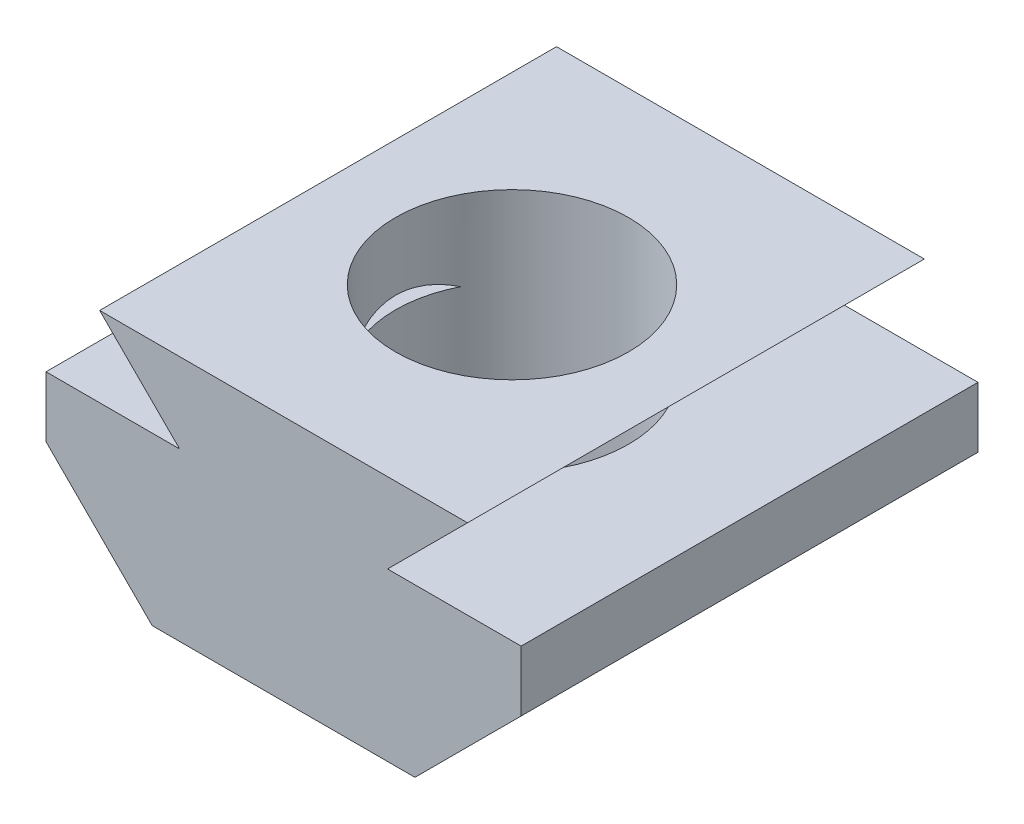
ISO-10303-21;
HEADER;
FILE_DESCRIPTION(('STEP AP214'),'2;1');
FILE_NAME('part.step','',(''),(''),'','','');
FILE_SCHEMA(('AUTOMOTIVE_DESIGN { 1 0 10303 214 1 1 1 1 }'));
ENDSEC;
DATA;
#1=APPLICATION_CONTEXT('core data for automotive mechanical design processes');
#2=APPLICATION_PROTOCOL_DEFINITION('international standard','automotive_design',2000,#1);
#3=PRODUCT_CONTEXT('',#1,'mechanical');
#4=PRODUCT('Part','Part','',(#3));
#5=PRODUCT_RELATED_PRODUCT_CATEGORY('part','',(#4));
#6=PRODUCT_DEFINITION_FORMATION('','',#4);
#7=PRODUCT_DEFINITION_CONTEXT('part definition',#1,'design');
#8=PRODUCT_DEFINITION('design','',#6,#7);
#9=PRODUCT_DEFINITION_SHAPE('','',#8);
#10=(LENGTH_UNIT() NAMED_UNIT(*) SI_UNIT(.MILLI.,.METRE.));
#11=(NAMED_UNIT(*) PLANE_ANGLE_UNIT() SI_UNIT($,.RADIAN.));
#12=(NAMED_UNIT(*) SI_UNIT($,.STERADIAN.) SOLID_ANGLE_UNIT());
#13=UNCERTAINTY_MEASURE_WITH_UNIT(LENGTH_MEASURE(1.E-05),#10,'distance_accuracy_value','');
#14=(GEOMETRIC_REPRESENTATION_CONTEXT(3) GLOBAL_UNCERTAINTY_ASSIGNED_CONTEXT((#13)) GLOBAL_UNIT_ASSIGNED_CONTEXT((#10,
#11,#12)) REPRESENTATION_CONTEXT('',''));
#15=CARTESIAN_POINT('',(0.,0.,0.));
#16=DIRECTION('',(0.,0.,1.));
#17=DIRECTION('',(1.,0.,0.));
#18=AXIS2_PLACEMENT_3D('',#15,#16,#17);
#19=CARTESIAN_POINT('',(-4.02573593128808,-0.3,10.));
#20=DIRECTION('',(0.707106781186548,0.707106781186547,0.));
#21=DIRECTION('',(-0.707106781186547,0.707106781186548,0.));
#22=AXIS2_PLACEMENT_3D('',#19,#20,#21);
#23=PLANE('',#22);
#24=DIRECTION('',(0.,0.,-1.));
#25=VECTOR('',#24,1.);
#26=CARTESIAN_POINT('',(-2.27573593128808,-2.05,10.));
#27=LINE('',#26,#25);
#28=CARTESIAN_POINT('',(-2.27573593128808,-2.05,3.84955401211339));
#29=VERTEX_POINT('',#28);
#30=CARTESIAN_POINT('',(-2.27573593128808,-2.05,0.));
#31=VERTEX_POINT('',#30);
#32=EDGE_CURVE('E44',#29,#31,#27,.T.);
#33=ORIENTED_EDGE('',*,*,#32,.F.);
#34=CARTESIAN_POINT('',(0.,-4.32573593128808,5.));
#35=DIRECTION('',(0.707106781186548,0.707106781186547,0.));
#36=DIRECTION('',(-0.707106781186547,0.707106781186548,0.));
#37=AXIS2_PLACEMENT_3D('',#34,#35,#36);
#38=ELLIPSE('',#37,3.60624458405139,2.55);
#39=CARTESIAN_POINT('',(-2.27573593128808,-2.05,6.15044598788661));
#40=VERTEX_POINT('',#39);
#41=EDGE_CURVE('E50',#29,#40,#38,.T.);
#42=ORIENTED_EDGE('',*,*,#41,.T.);
#43=CARTESIAN_POINT('',(-2.27573593128808,-2.05,10.));
#44=VERTEX_POINT('',#43);
#45=EDGE_CURVE('E11',#44,#40,#27,.T.);
#46=ORIENTED_EDGE('',*,*,#45,.F.);
#47=DIRECTION('',(0.707106781186547,-0.707106781186548,0.));
#48=VECTOR('',#47,1.);
#49=CARTESIAN_POINT('',(-4.02573593128808,-0.3,10.));
#50=LINE('',#49,#48);
#51=CARTESIAN_POINT('',(-4.02573593128808,-0.3,10.));
#52=VERTEX_POINT('',#51);
#53=EDGE_CURVE('E206',#52,#44,#50,.T.);
#54=ORIENTED_EDGE('',*,*,#53,.F.);
#55=DIRECTION('',(0.,0.,-1.));
#56=VECTOR('',#55,1.);
#57=CARTESIAN_POINT('',(-4.02573593128808,-0.3,10.));
#58=LINE('',#57,#56);
#59=CARTESIAN_POINT('',(-4.02573593128808,-0.3,0.));
#60=VERTEX_POINT('',#59);
#61=EDGE_CURVE('E185',#52,#60,#58,.T.);
#62=ORIENTED_EDGE('',*,*,#61,.T.);
#63=DIRECTION('',(0.707106781186547,-0.707106781186548,0.));
#64=VECTOR('',#63,1.);
#65=CARTESIAN_POINT('',(-4.02573593128808,-0.3,0.));
#66=LINE('',#65,#64);
#67=EDGE_CURVE('E178',#60,#31,#66,.T.);
#68=ORIENTED_EDGE('',*,*,#67,.T.);
#69=EDGE_LOOP('',(#33,#42,#46,#54,#62,#68));
#70=FACE_BOUND('',#69,.T.);
#71=ADVANCED_FACE('F37',(#70),#23,.F.);
#72=CARTESIAN_POINT('',(-2.27573593128808,-2.05,10.));
#73=DIRECTION('',(0.,-1.,0.));
#74=DIRECTION('',(0.,0.,-1.));
#75=AXIS2_PLACEMENT_3D('',#72,#73,#74);
#76=PLANE('',#75);
#77=ORIENTED_EDGE('',*,*,#45,.T.);
#78=CARTESIAN_POINT('',(0.,-2.05,5.));
#79=DIRECTION('',(0.,-1.,0.));
#80=DIRECTION('',(0.,0.,-1.));
#81=AXIS2_PLACEMENT_3D('',#78,#79,#80);
#82=CIRCLE('',#81,2.55);
#83=EDGE_CURVE('E137',#40,#29,#82,.T.);
#84=ORIENTED_EDGE('',*,*,#83,.T.);
#85=ORIENTED_EDGE('',*,*,#32,.T.);
#86=DIRECTION('',(-1.,0.,0.));
#87=VECTOR('',#86,1.);
#88=CARTESIAN_POINT('',(-2.27573593128808,-2.05,0.));
#89=LINE('',#88,#87);
#90=CARTESIAN_POINT('',(-5.20000000000001,-2.05,0.));
#91=VERTEX_POINT('',#90);
#92=EDGE_CURVE('E171',#31,#91,#89,.T.);
#93=ORIENTED_EDGE('',*,*,#92,.T.);
#94=DIRECTION('',(0.,0.,-1.));
#95=VECTOR('',#94,1.);
#96=CARTESIAN_POINT('',(-5.20000000000001,-2.05,10.));
#97=LINE('',#96,#95);
#98=CARTESIAN_POINT('',(-5.20000000000001,-2.05,10.));
#99=VERTEX_POINT('',#98);
#100=EDGE_CURVE('E161',#99,#91,#97,.T.);
#101=ORIENTED_EDGE('',*,*,#100,.F.);
#102=DIRECTION('',(-1.,0.,0.));
#103=VECTOR('',#102,1.);
#104=CARTESIAN_POINT('',(-2.27573593128808,-2.05,10.));
#105=LINE('',#104,#103);
#106=EDGE_CURVE('E224',#44,#99,#105,.T.);
#107=ORIENTED_EDGE('',*,*,#106,.F.);
#108=EDGE_LOOP('',(#77,#84,#85,#93,#101,#107));
#109=FACE_BOUND('',#108,.T.);
#110=ADVANCED_FACE('F170',(#109),#76,.F.);
#111=CARTESIAN_POINT('',(-5.20000000000001,-2.05,10.));
#112=DIRECTION('',(1.,0.,0.));
#113=DIRECTION('',(0.,0.,-1.));
#114=AXIS2_PLACEMENT_3D('',#111,#112,#113);
#115=PLANE('',#114);
#116=DIRECTION('',(0.,-1.,0.));
#117=VECTOR('',#116,1.);
#118=CARTESIAN_POINT('',(-5.20000000000001,-2.05,0.));
#119=LINE('',#118,#117);
#120=CARTESIAN_POINT('',(-5.20000000000001,-3.37573593128806,0.));
#121=VERTEX_POINT('',#120);
#122=EDGE_CURVE('E180',#91,#121,#119,.T.);
#123=ORIENTED_EDGE('',*,*,#122,.T.);
#124=DIRECTION('',(0.,0.,-1.));
#125=VECTOR('',#124,1.);
#126=CARTESIAN_POINT('',(-5.20000000000001,-3.37573593128806,10.));
#127=LINE('',#126,#125);
#128=CARTESIAN_POINT('',(-5.20000000000001,-3.37573593128806,10.));
#129=VERTEX_POINT('',#128);
#130=EDGE_CURVE('E159',#129,#121,#127,.T.);
#131=ORIENTED_EDGE('',*,*,#130,.F.);
#132=DIRECTION('',(0.,-1.,0.));
#133=VECTOR('',#132,1.);
#134=CARTESIAN_POINT('',(-5.20000000000001,-2.05,10.));
#135=LINE('',#134,#133);
#136=EDGE_CURVE('E222',#99,#129,#135,.T.);
#137=ORIENTED_EDGE('',*,*,#136,.F.);
#138=ORIENTED_EDGE('',*,*,#100,.T.);
#139=EDGE_LOOP('',(#123,#131,#137,#138));
#140=FACE_BOUND('',#139,.T.);
#141=ADVANCED_FACE('F267',(#140),#115,.F.);
#142=CARTESIAN_POINT('',(-5.20000000000001,-3.37573593128806,10.));
#143=DIRECTION('',(0.707106781186548,0.707106781186548,0.));
#144=DIRECTION('',(-0.707106781186548,0.707106781186548,0.));
#145=AXIS2_PLACEMENT_3D('',#142,#143,#144);
#146=PLANE('',#145);
#147=DIRECTION('',(0.707106781186548,-0.707106781186548,0.));
#148=VECTOR('',#147,1.);
#149=CARTESIAN_POINT('',(-5.20000000000001,-3.37573593128806,0.));
#150=LINE('',#149,#148);
#151=CARTESIAN_POINT('',(-2.87573593128807,-5.7,0.));
#152=VERTEX_POINT('',#151);
#153=EDGE_CURVE('E193',#121,#152,#150,.T.);
#154=ORIENTED_EDGE('',*,*,#153,.T.);
#155=DIRECTION('',(0.,0.,-1.));
#156=VECTOR('',#155,1.);
#157=CARTESIAN_POINT('',(-2.87573593128807,-5.7,10.));
#158=LINE('',#157,#156);
#159=CARTESIAN_POINT('',(-2.87573593128807,-5.7,10.));
#160=VERTEX_POINT('',#159);
#161=EDGE_CURVE('E156',#160,#152,#158,.T.);
#162=ORIENTED_EDGE('',*,*,#161,.F.);
#163=DIRECTION('',(0.707106781186548,-0.707106781186548,0.));
#164=VECTOR('',#163,1.);
#165=CARTESIAN_POINT('',(-5.20000000000001,-3.37573593128806,10.));
#166=LINE('',#165,#164);
#167=EDGE_CURVE('E220',#129,#160,#166,.T.);
#168=ORIENTED_EDGE('',*,*,#167,.F.);
#169=ORIENTED_EDGE('',*,*,#130,.T.);
#170=EDGE_LOOP('',(#154,#162,#168,#169));
#171=FACE_BOUND('',#170,.T.);
#172=ADVANCED_FACE('F265',(#171),#146,.F.);
#173=CARTESIAN_POINT('',(2.87573593128807,-5.7,10.));
#174=DIRECTION('',(0.,1.,0.));
#175=DIRECTION('',(0.,0.,1.));
#176=AXIS2_PLACEMENT_3D('',#173,#174,#175);
#177=PLANE('',#176);
#178=CARTESIAN_POINT('',(0.,-5.7,5.));
#179=DIRECTION('',(0.,1.,0.));
#180=DIRECTION('',(-1.,0.,0.));
#181=AXIS2_PLACEMENT_3D('',#178,#179,#180);
#182=CIRCLE('',#181,2.55);
#183=CARTESIAN_POINT('',(-2.55,-5.7,5.));
#184=VERTEX_POINT('',#183);
#185=EDGE_CURVE('E127',#184,#184,#182,.T.);
#186=ORIENTED_EDGE('',*,*,#185,.T.);
#187=EDGE_LOOP('',(#186));
#188=FACE_BOUND('',#187,.T.);
#189=DIRECTION('',(1.,0.,0.));
#190=VECTOR('',#189,1.);
#191=CARTESIAN_POINT('',(2.87573593128807,-5.7,0.));
#192=LINE('',#191,#190);
#193=CARTESIAN_POINT('',(2.87573593128807,-5.7,0.));
#194=VERTEX_POINT('',#193);
#195=EDGE_CURVE('E195',#152,#194,#192,.T.);
#196=ORIENTED_EDGE('',*,*,#195,.T.);
#197=DIRECTION('',(0.,0.,-1.));
#198=VECTOR('',#197,1.);
#199=CARTESIAN_POINT('',(2.87573593128807,-5.7,10.));
#200=LINE('',#199,#198);
#201=CARTESIAN_POINT('',(2.87573593128807,-5.7,10.));
#202=VERTEX_POINT('',#201);
#203=EDGE_CURVE('E153',#202,#194,#200,.T.);
#204=ORIENTED_EDGE('',*,*,#203,.F.);
#205=DIRECTION('',(1.,0.,0.));
#206=VECTOR('',#205,1.);
#207=CARTESIAN_POINT('',(2.87573593128807,-5.7,10.));
#208=LINE('',#207,#206);
#209=EDGE_CURVE('E218',#160,#202,#208,.T.);
#210=ORIENTED_EDGE('',*,*,#209,.F.);
#211=ORIENTED_EDGE('',*,*,#161,.T.);
#212=EDGE_LOOP('',(#196,#204,#210,#211));
#213=FACE_BOUND('',#212,.T.);
#214=ADVANCED_FACE('F234',(#188,#213),#177,.F.);
#215=CARTESIAN_POINT('',(5.2,-3.37573593128807,10.));
#216=DIRECTION('',(-0.707106781186548,0.707106781186548,0.));
#217=DIRECTION('',(-0.707106781186548,-0.707106781186548,0.));
#218=AXIS2_PLACEMENT_3D('',#215,#216,#217);
#219=PLANE('',#218);
#220=DIRECTION('',(0.707106781186548,0.707106781186548,0.));
#221=VECTOR('',#220,1.);
#222=CARTESIAN_POINT('',(5.2,-3.37573593128807,0.));
#223=LINE('',#222,#221);
#224=CARTESIAN_POINT('',(5.2,-3.37573593128807,0.));
#225=VERTEX_POINT('',#224);
#226=EDGE_CURVE('E197',#194,#225,#223,.T.);
#227=ORIENTED_EDGE('',*,*,#226,.T.);
#228=DIRECTION('',(0.,0.,-1.));
#229=VECTOR('',#228,1.);
#230=CARTESIAN_POINT('',(5.2,-3.37573593128807,10.));
#231=LINE('',#230,#229);
#232=CARTESIAN_POINT('',(5.2,-3.37573593128807,10.));
#233=VERTEX_POINT('',#232);
#234=EDGE_CURVE('E145',#233,#225,#231,.T.);
#235=ORIENTED_EDGE('',*,*,#234,.F.);
#236=DIRECTION('',(0.707106781186548,0.707106781186548,0.));
#237=VECTOR('',#236,1.);
#238=CARTESIAN_POINT('',(5.2,-3.37573593128807,10.));
#239=LINE('',#238,#237);
#240=EDGE_CURVE('E216',#202,#233,#239,.T.);
#241=ORIENTED_EDGE('',*,*,#240,.F.);
#242=ORIENTED_EDGE('',*,*,#203,.T.);
#243=EDGE_LOOP('',(#227,#235,#241,#242));
#244=FACE_BOUND('',#243,.T.);
#245=ADVANCED_FACE('F258',(#244),#219,.F.);
#246=CARTESIAN_POINT('',(5.2,-2.05,10.));
#247=DIRECTION('',(-1.,0.,0.));
#248=DIRECTION('',(0.,0.,1.));
#249=AXIS2_PLACEMENT_3D('',#246,#247,#248);
#250=PLANE('',#249);
#251=DIRECTION('',(0.,1.,0.));
#252=VECTOR('',#251,1.);
#253=CARTESIAN_POINT('',(5.2,-2.05,0.));
#254=LINE('',#253,#252);
#255=CARTESIAN_POINT('',(5.2,-2.05,0.));
#256=VERTEX_POINT('',#255);
#257=EDGE_CURVE('E199',#225,#256,#254,.T.);
#258=ORIENTED_EDGE('',*,*,#257,.T.);
#259=DIRECTION('',(0.,0.,-1.));
#260=VECTOR('',#259,1.);
#261=CARTESIAN_POINT('',(5.2,-2.05,10.));
#262=LINE('',#261,#260);
#263=CARTESIAN_POINT('',(5.2,-2.05,10.));
#264=VERTEX_POINT('',#263);
#265=EDGE_CURVE('E142',#264,#256,#262,.T.);
#266=ORIENTED_EDGE('',*,*,#265,.F.);
#267=DIRECTION('',(0.,1.,0.));
#268=VECTOR('',#267,1.);
#269=CARTESIAN_POINT('',(5.2,-2.05,10.));
#270=LINE('',#269,#268);
#271=EDGE_CURVE('E212',#233,#264,#270,.T.);
#272=ORIENTED_EDGE('',*,*,#271,.F.);
#273=ORIENTED_EDGE('',*,*,#234,.T.);
#274=EDGE_LOOP('',(#258,#266,#272,#273));
#275=FACE_BOUND('',#274,.T.);
#276=ADVANCED_FACE('F253',(#275),#250,.F.);
#277=CARTESIAN_POINT('',(2.27573593128806,-2.05,10.));
#278=DIRECTION('',(0.,-1.,0.));
#279=DIRECTION('',(0.,0.,-1.));
#280=AXIS2_PLACEMENT_3D('',#277,#278,#279);
#281=PLANE('',#280);
#282=DIRECTION('',(0.,0.,-1.));
#283=VECTOR('',#282,1.);
#284=CARTESIAN_POINT('',(2.27573593128806,-2.05,10.));
#285=LINE('',#284,#283);
#286=CARTESIAN_POINT('',(2.27573593128806,-2.05,3.84955401211337));
#287=VERTEX_POINT('',#286);
#288=CARTESIAN_POINT('',(2.27573593128806,-2.05,0.));
#289=VERTEX_POINT('',#288);
#290=EDGE_CURVE('E136',#287,#289,#285,.T.);
#291=ORIENTED_EDGE('',*,*,#290,.F.);
#292=CARTESIAN_POINT('',(0.,-2.05,5.));
#293=DIRECTION('',(0.,-1.,0.));
#294=DIRECTION('',(0.,0.,-1.));
#295=AXIS2_PLACEMENT_3D('',#292,#293,#294);
#296=CIRCLE('',#295,2.55);
#297=CARTESIAN_POINT('',(2.27573593128806,-2.05,6.15044598788663));
#298=VERTEX_POINT('',#297);
#299=EDGE_CURVE('E57',#287,#298,#296,.T.);
#300=ORIENTED_EDGE('',*,*,#299,.T.);
#301=CARTESIAN_POINT('',(2.27573593128806,-2.05,10.));
#302=VERTEX_POINT('',#301);
#303=EDGE_CURVE('E133',#302,#298,#285,.T.);
#304=ORIENTED_EDGE('',*,*,#303,.F.);
#305=DIRECTION('',(-1.,0.,0.));
#306=VECTOR('',#305,1.);
#307=CARTESIAN_POINT('',(2.27573593128806,-2.05,10.));
#308=LINE('',#307,#306);
#309=EDGE_CURVE('E211',#264,#302,#308,.T.);
#310=ORIENTED_EDGE('',*,*,#309,.F.);
#311=ORIENTED_EDGE('',*,*,#265,.T.);
#312=DIRECTION('',(-1.,0.,0.));
#313=VECTOR('',#312,1.);
#314=CARTESIAN_POINT('',(2.27573593128806,-2.05,0.));
#315=LINE('',#314,#313);
#316=EDGE_CURVE('E201',#256,#289,#315,.T.);
#317=ORIENTED_EDGE('',*,*,#316,.T.);
#318=EDGE_LOOP('',(#291,#300,#304,#310,#311,#317));
#319=FACE_BOUND('',#318,.T.);
#320=ADVANCED_FACE('F131',(#319),#281,.F.);
#321=CARTESIAN_POINT('',(4.02573593128807,-0.3,10.));
#322=DIRECTION('',(-0.707106781186545,0.70710678118655,0.));
#323=DIRECTION('',(-0.70710678118655,-0.707106781186545,0.));
#324=AXIS2_PLACEMENT_3D('',#321,#322,#323);
#325=PLANE('',#324);
#326=ORIENTED_EDGE('',*,*,#303,.T.);
#327=CARTESIAN_POINT('',(0.,-4.32573593128805,5.));
#328=DIRECTION('',(-0.707106781186545,0.70710678118655,0.));
#329=DIRECTION('',(0.70710678118655,0.707106781186545,0.));
#330=AXIS2_PLACEMENT_3D('',#327,#328,#329);
#331=ELLIPSE('',#330,3.60624458405138,2.55);
#332=EDGE_CURVE('E122',#298,#287,#331,.T.);
#333=ORIENTED_EDGE('',*,*,#332,.T.);
#334=ORIENTED_EDGE('',*,*,#290,.T.);
#335=DIRECTION('',(0.70710678118655,0.707106781186545,0.));
#336=VECTOR('',#335,1.);
#337=CARTESIAN_POINT('',(4.02573593128807,-0.3,0.));
#338=LINE('',#337,#336);
#339=CARTESIAN_POINT('',(4.02573593128807,-0.3,0.));
#340=VERTEX_POINT('',#339);
#341=EDGE_CURVE('E203',#289,#340,#338,.T.);
#342=ORIENTED_EDGE('',*,*,#341,.T.);
#343=DIRECTION('',(0.,0.,-1.));
#344=VECTOR('',#343,1.);
#345=CARTESIAN_POINT('',(4.02573593128807,-0.3,10.));
#346=LINE('',#345,#344);
#347=CARTESIAN_POINT('',(4.02573593128807,-0.3,10.));
#348=VERTEX_POINT('',#347);
#349=EDGE_CURVE('E147',#348,#340,#346,.T.);
#350=ORIENTED_EDGE('',*,*,#349,.F.);
#351=DIRECTION('',(0.70710678118655,0.707106781186545,0.));
#352=VECTOR('',#351,1.);
#353=CARTESIAN_POINT('',(4.02573593128807,-0.3,10.));
#354=LINE('',#353,#352);
#355=EDGE_CURVE('E141',#302,#348,#354,.T.);
#356=ORIENTED_EDGE('',*,*,#355,.F.);
#357=EDGE_LOOP('',(#326,#333,#334,#342,#350,#356));
#358=FACE_BOUND('',#357,.T.);
#359=ADVANCED_FACE('F139',(#358),#325,.F.);
#360=CARTESIAN_POINT('',(-4.02573593128808,-0.3,10.));
#361=DIRECTION('',(0.,-1.,0.));
#362=DIRECTION('',(1.,0.,0.));
#363=AXIS2_PLACEMENT_3D('',#360,#361,#362);
#364=PLANE('',#363);
#365=CARTESIAN_POINT('',(0.,-0.3,5.));
#366=DIRECTION('',(0.,1.,0.));
#367=DIRECTION('',(-1.,0.,0.));
#368=AXIS2_PLACEMENT_3D('',#365,#366,#367);
#369=CIRCLE('',#368,2.55);
#370=CARTESIAN_POINT('',(-2.55,-0.3,5.));
#371=VERTEX_POINT('',#370);
#372=EDGE_CURVE('E228',#371,#371,#369,.T.);
#373=ORIENTED_EDGE('',*,*,#372,.F.);
#374=EDGE_LOOP('',(#373));
#375=FACE_BOUND('',#374,.T.);
#376=DIRECTION('',(-1.,0.,0.));
#377=VECTOR('',#376,1.);
#378=CARTESIAN_POINT('',(-4.02573593128808,-0.3,0.));
#379=LINE('',#378,#377);
#380=EDGE_CURVE('E205',#340,#60,#379,.T.);
#381=ORIENTED_EDGE('',*,*,#380,.T.);
#382=ORIENTED_EDGE('',*,*,#61,.F.);
#383=DIRECTION('',(-1.,0.,0.));
#384=VECTOR('',#383,1.);
#385=CARTESIAN_POINT('',(-4.02573593128808,-0.3,10.));
#386=LINE('',#385,#384);
#387=EDGE_CURVE('E189',#348,#52,#386,.T.);
#388=ORIENTED_EDGE('',*,*,#387,.F.);
#389=ORIENTED_EDGE('',*,*,#349,.T.);
#390=EDGE_LOOP('',(#381,#382,#388,#389));
#391=FACE_BOUND('',#390,.T.);
#392=ADVANCED_FACE('F242',(#375,#391),#364,.F.);
#393=CARTESIAN_POINT('',(0.,0.,10.));
#394=DIRECTION('',(0.,0.,-1.));
#395=DIRECTION('',(-1.,0.,0.));
#396=AXIS2_PLACEMENT_3D('',#393,#394,#395);
#397=PLANE('',#396);
#398=ORIENTED_EDGE('',*,*,#53,.T.);
#399=ORIENTED_EDGE('',*,*,#106,.T.);
#400=ORIENTED_EDGE('',*,*,#136,.T.);
#401=ORIENTED_EDGE('',*,*,#167,.T.);
#402=ORIENTED_EDGE('',*,*,#209,.T.);
#403=ORIENTED_EDGE('',*,*,#240,.T.);
#404=ORIENTED_EDGE('',*,*,#271,.T.);
#405=ORIENTED_EDGE('',*,*,#309,.T.);
#406=ORIENTED_EDGE('',*,*,#355,.T.);
#407=ORIENTED_EDGE('',*,*,#387,.T.);
#408=EDGE_LOOP('',(#398,#399,#400,#401,#402,#403,#404,#405,#406,#407));
#409=FACE_BOUND('',#408,.T.);
#410=ADVANCED_FACE('F245',(#409),#397,.F.);
#411=CARTESIAN_POINT('',(0.,0.,0.));
#412=DIRECTION('',(0.,0.,-1.));
#413=DIRECTION('',(-1.,0.,0.));
#414=AXIS2_PLACEMENT_3D('',#411,#412,#413);
#415=PLANE('',#414);
#416=ORIENTED_EDGE('',*,*,#67,.F.);
#417=ORIENTED_EDGE('',*,*,#380,.F.);
#418=ORIENTED_EDGE('',*,*,#341,.F.);
#419=ORIENTED_EDGE('',*,*,#316,.F.);
#420=ORIENTED_EDGE('',*,*,#257,.F.);
#421=ORIENTED_EDGE('',*,*,#226,.F.);
#422=ORIENTED_EDGE('',*,*,#195,.F.);
#423=ORIENTED_EDGE('',*,*,#153,.F.);
#424=ORIENTED_EDGE('',*,*,#122,.F.);
#425=ORIENTED_EDGE('',*,*,#92,.F.);
#426=EDGE_LOOP('',(#416,#417,#418,#419,#420,#421,#422,#423,#424,#425));
#427=FACE_BOUND('',#426,.T.);
#428=ADVANCED_FACE('F176',(#427),#415,.T.);
#429=CARTESIAN_POINT('',(0.,-5.7,5.));
#430=DIRECTION('',(0.,1.,0.));
#431=DIRECTION('',(-1.,0.,0.));
#432=AXIS2_PLACEMENT_3D('',#429,#430,#431);
#433=CYLINDRICAL_SURFACE('',#432,2.55);
#434=ORIENTED_EDGE('',*,*,#185,.F.);
#435=EDGE_LOOP('',(#434));
#436=FACE_BOUND('',#435,.T.);
#437=ORIENTED_EDGE('',*,*,#372,.T.);
#438=EDGE_LOOP('',(#437));
#439=FACE_BOUND('',#438,.T.);
#440=ORIENTED_EDGE('',*,*,#332,.F.);
#441=ORIENTED_EDGE('',*,*,#299,.F.);
#442=EDGE_LOOP('',(#440,#441));
#443=FACE_BOUND('',#442,.T.);
#444=ORIENTED_EDGE('',*,*,#83,.F.);
#445=ORIENTED_EDGE('',*,*,#41,.F.);
#446=EDGE_LOOP('',(#444,#445));
#447=FACE_BOUND('',#446,.T.);
#448=ADVANCED_FACE('F123',(#436,#439,#443,#447),#433,.F.);
#449=CLOSED_SHELL('',(#71,#110,#141,#172,#214,#245,#276,#320,#359,#392,#410,#428,#448));
#450=MANIFOLD_SOLID_BREP('B2',#449);
#451=ADVANCED_BREP_SHAPE_REPRESENTATION('',(#18,#450),#14);
#452=SHAPE_DEFINITION_REPRESENTATION(#9,#451);
ENDSEC;
END-ISO-10303-21;
